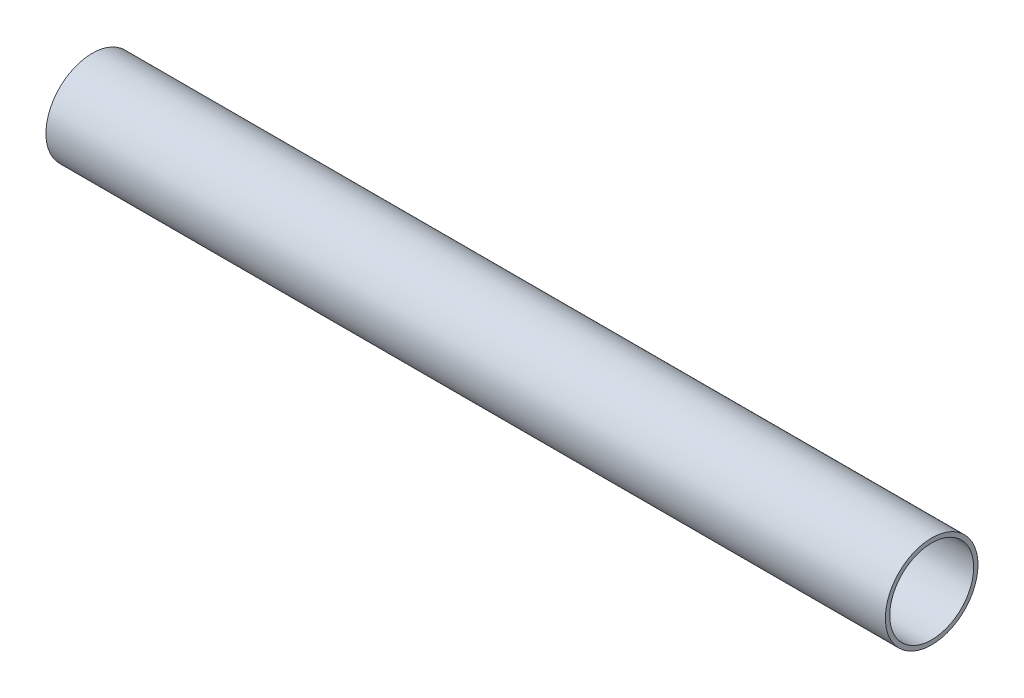
ISO-10303-21;
HEADER;
FILE_DESCRIPTION(('STEP AP214'),'2;1');
FILE_NAME('part.step','',(''),(''),'','','');
FILE_SCHEMA(('AUTOMOTIVE_DESIGN { 1 0 10303 214 1 1 1 1 }'));
ENDSEC;
DATA;
#1=APPLICATION_CONTEXT('core data for automotive mechanical design processes');
#2=APPLICATION_PROTOCOL_DEFINITION('international standard','automotive_design',2000,#1);
#3=PRODUCT_CONTEXT('',#1,'mechanical');
#4=PRODUCT('Part','Part','',(#3));
#5=PRODUCT_RELATED_PRODUCT_CATEGORY('part','',(#4));
#6=PRODUCT_DEFINITION_FORMATION('','',#4);
#7=PRODUCT_DEFINITION_CONTEXT('part definition',#1,'design');
#8=PRODUCT_DEFINITION('design','',#6,#7);
#9=PRODUCT_DEFINITION_SHAPE('','',#8);
#10=(LENGTH_UNIT() NAMED_UNIT(*) SI_UNIT(.MILLI.,.METRE.));
#11=(NAMED_UNIT(*) PLANE_ANGLE_UNIT() SI_UNIT($,.RADIAN.));
#12=(NAMED_UNIT(*) SI_UNIT($,.STERADIAN.) SOLID_ANGLE_UNIT());
#13=UNCERTAINTY_MEASURE_WITH_UNIT(LENGTH_MEASURE(1.E-05),#10,'distance_accuracy_value','');
#14=(GEOMETRIC_REPRESENTATION_CONTEXT(3) GLOBAL_UNCERTAINTY_ASSIGNED_CONTEXT((#13)) GLOBAL_UNIT_ASSIGNED_CONTEXT((#10,
#11,#12)) REPRESENTATION_CONTEXT('',''));
#15=CARTESIAN_POINT('',(0.,0.,0.));
#16=DIRECTION('',(0.,0.,1.));
#17=DIRECTION('',(1.,0.,0.));
#18=AXIS2_PLACEMENT_3D('',#15,#16,#17);
#19=CARTESIAN_POINT('',(0.,0.,0.));
#20=DIRECTION('',(1.,0.,0.));
#21=DIRECTION('',(0.,0.,-1.));
#22=AXIS2_PLACEMENT_3D('',#19,#20,#21);
#23=CYLINDRICAL_SURFACE('',#22,7.25);
#24=CARTESIAN_POINT('',(145.,0.,0.));
#25=DIRECTION('',(1.,0.,0.));
#26=DIRECTION('',(0.,0.,-1.));
#27=AXIS2_PLACEMENT_3D('',#24,#25,#26);
#28=CIRCLE('',#27,7.25);
#29=CARTESIAN_POINT('',(145.,0.,-7.25));
#30=VERTEX_POINT('',#29);
#31=EDGE_CURVE('E15',#30,#30,#28,.F.);
#32=ORIENTED_EDGE('',*,*,#31,.F.);
#33=EDGE_LOOP('',(#32));
#34=FACE_BOUND('',#33,.T.);
#35=CARTESIAN_POINT('',(0.,0.,0.));
#36=DIRECTION('',(1.,0.,0.));
#37=DIRECTION('',(0.,0.,-1.));
#38=AXIS2_PLACEMENT_3D('',#35,#36,#37);
#39=CIRCLE('',#38,7.25);
#40=CARTESIAN_POINT('',(0.,0.,-7.25));
#41=VERTEX_POINT('',#40);
#42=EDGE_CURVE('E24',#41,#41,#39,.F.);
#43=ORIENTED_EDGE('',*,*,#42,.T.);
#44=EDGE_LOOP('',(#43));
#45=FACE_BOUND('',#44,.T.);
#46=ADVANCED_FACE('F12',(#34,#45),#23,.F.);
#47=CARTESIAN_POINT('',(145.,0.,0.));
#48=DIRECTION('',(1.,0.,0.));
#49=DIRECTION('',(0.,0.,-1.));
#50=AXIS2_PLACEMENT_3D('',#47,#48,#49);
#51=PLANE('',#50);
#52=ORIENTED_EDGE('',*,*,#31,.T.);
#53=EDGE_LOOP('',(#52));
#54=FACE_BOUND('',#53,.T.);
#55=CARTESIAN_POINT('',(145.,0.,0.));
#56=DIRECTION('',(1.,0.,0.));
#57=DIRECTION('',(0.,0.,-1.));
#58=AXIS2_PLACEMENT_3D('',#55,#56,#57);
#59=CIRCLE('',#58,8.);
#60=CARTESIAN_POINT('',(145.,0.,-8.));
#61=VERTEX_POINT('',#60);
#62=EDGE_CURVE('E19',#61,#61,#59,.F.);
#63=ORIENTED_EDGE('',*,*,#62,.F.);
#64=EDGE_LOOP('',(#63));
#65=FACE_BOUND('',#64,.T.);
#66=ADVANCED_FACE('F32',(#54,#65),#51,.T.);
#67=CARTESIAN_POINT('',(0.,0.,0.));
#68=DIRECTION('',(1.,0.,0.));
#69=DIRECTION('',(0.,0.,-1.));
#70=AXIS2_PLACEMENT_3D('',#67,#68,#69);
#71=PLANE('',#70);
#72=ORIENTED_EDGE('',*,*,#42,.F.);
#73=EDGE_LOOP('',(#72));
#74=FACE_BOUND('',#73,.T.);
#75=CARTESIAN_POINT('',(0.,0.,0.));
#76=DIRECTION('',(1.,0.,0.));
#77=DIRECTION('',(0.,0.,-1.));
#78=AXIS2_PLACEMENT_3D('',#75,#76,#77);
#79=CIRCLE('',#78,8.);
#80=CARTESIAN_POINT('',(0.,0.,-8.));
#81=VERTEX_POINT('',#80);
#82=EDGE_CURVE('E8',#81,#81,#79,.T.);
#83=ORIENTED_EDGE('',*,*,#82,.F.);
#84=EDGE_LOOP('',(#83));
#85=FACE_BOUND('',#84,.T.);
#86=ADVANCED_FACE('F40',(#74,#85),#71,.F.);
#87=CARTESIAN_POINT('',(0.,0.,0.));
#88=DIRECTION('',(1.,0.,0.));
#89=DIRECTION('',(0.,0.,-1.));
#90=AXIS2_PLACEMENT_3D('',#87,#88,#89);
#91=CYLINDRICAL_SURFACE('',#90,8.);
#92=ORIENTED_EDGE('',*,*,#62,.T.);
#93=EDGE_LOOP('',(#92));
#94=FACE_BOUND('',#93,.T.);
#95=ORIENTED_EDGE('',*,*,#82,.T.);
#96=EDGE_LOOP('',(#95));
#97=FACE_BOUND('',#96,.T.);
#98=ADVANCED_FACE('F41',(#94,#97),#91,.T.);
#99=CLOSED_SHELL('',(#46,#66,#86,#98));
#100=MANIFOLD_SOLID_BREP('B1',#99);
#101=ADVANCED_BREP_SHAPE_REPRESENTATION('',(#18,#100),#14);
#102=SHAPE_DEFINITION_REPRESENTATION(#9,#101);
ENDSEC;
END-ISO-10303-21;
